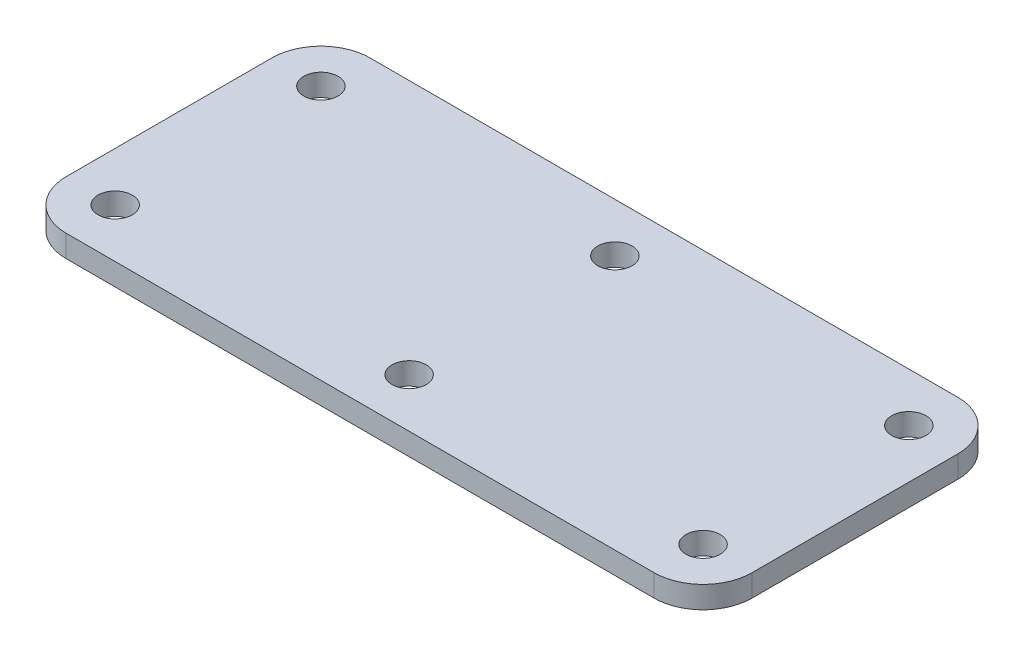
ISO-10303-21;
HEADER;
FILE_DESCRIPTION(('STEP AP214'),'2;1');
FILE_NAME('part.step','',(''),(''),'','','');
FILE_SCHEMA(('AUTOMOTIVE_DESIGN { 1 0 10303 214 1 1 1 1 }'));
ENDSEC;
DATA;
#1=APPLICATION_CONTEXT('core data for automotive mechanical design processes');
#2=APPLICATION_PROTOCOL_DEFINITION('international standard','automotive_design',2000,#1);
#3=PRODUCT_CONTEXT('',#1,'mechanical');
#4=PRODUCT('Part','Part','',(#3));
#5=PRODUCT_RELATED_PRODUCT_CATEGORY('part','',(#4));
#6=PRODUCT_DEFINITION_FORMATION('','',#4);
#7=PRODUCT_DEFINITION_CONTEXT('part definition',#1,'design');
#8=PRODUCT_DEFINITION('design','',#6,#7);
#9=PRODUCT_DEFINITION_SHAPE('','',#8);
#10=(LENGTH_UNIT() NAMED_UNIT(*) SI_UNIT(.MILLI.,.METRE.));
#11=(NAMED_UNIT(*) PLANE_ANGLE_UNIT() SI_UNIT($,.RADIAN.));
#12=(NAMED_UNIT(*) SI_UNIT($,.STERADIAN.) SOLID_ANGLE_UNIT());
#13=UNCERTAINTY_MEASURE_WITH_UNIT(LENGTH_MEASURE(1.E-05),#10,'distance_accuracy_value','');
#14=(GEOMETRIC_REPRESENTATION_CONTEXT(3) GLOBAL_UNCERTAINTY_ASSIGNED_CONTEXT((#13)) GLOBAL_UNIT_ASSIGNED_CONTEXT((#10,
#11,#12)) REPRESENTATION_CONTEXT('',''));
#15=CARTESIAN_POINT('',(0.,0.,0.));
#16=DIRECTION('',(0.,0.,1.));
#17=DIRECTION('',(1.,0.,0.));
#18=AXIS2_PLACEMENT_3D('',#15,#16,#17);
#19=CARTESIAN_POINT('',(-23.7329633323304,4.5,595.150162880876));
#20=DIRECTION('',(0.,1.,0.));
#21=DIRECTION('',(0.,0.,1.));
#22=AXIS2_PLACEMENT_3D('',#19,#20,#21);
#23=PLANE('',#22);
#24=CARTESIAN_POINT('',(96.2670366676696,4.5,595.150162880876));
#25=DIRECTION('',(0.,1.,0.));
#26=DIRECTION('',(0.,0.,1.));
#27=AXIS2_PLACEMENT_3D('',#24,#25,#26);
#28=CIRCLE('',#27,3.49999999999997);
#29=CARTESIAN_POINT('',(96.2670366676696,4.5,598.650162880876));
#30=VERTEX_POINT('',#29);
#31=EDGE_CURVE('E248',#30,#30,#28,.T.);
#32=ORIENTED_EDGE('',*,*,#31,.F.);
#33=EDGE_LOOP('',(#32));
#34=FACE_BOUND('',#33,.T.);
#35=CARTESIAN_POINT('',(-23.7329633323305,4.5,553.150162880876));
#36=DIRECTION('',(0.,1.,0.));
#37=DIRECTION('',(0.,0.,1.));
#38=AXIS2_PLACEMENT_3D('',#35,#36,#37);
#39=CIRCLE('',#38,3.49999999999996);
#40=CARTESIAN_POINT('',(-23.7329633323305,4.5,556.650162880876));
#41=VERTEX_POINT('',#40);
#42=EDGE_CURVE('E233',#41,#41,#39,.T.);
#43=ORIENTED_EDGE('',*,*,#42,.F.);
#44=EDGE_LOOP('',(#43));
#45=FACE_BOUND('',#44,.T.);
#46=CARTESIAN_POINT('',(36.2670366676696,4.5,553.150162880876));
#47=DIRECTION('',(0.,1.,0.));
#48=DIRECTION('',(0.,0.,1.));
#49=AXIS2_PLACEMENT_3D('',#46,#47,#48);
#50=CIRCLE('',#49,3.49999999999997);
#51=CARTESIAN_POINT('',(36.2670366676696,4.5,556.650162880876));
#52=VERTEX_POINT('',#51);
#53=EDGE_CURVE('E158',#52,#52,#50,.T.);
#54=ORIENTED_EDGE('',*,*,#53,.F.);
#55=EDGE_LOOP('',(#54));
#56=FACE_BOUND('',#55,.T.);
#57=CARTESIAN_POINT('',(-23.7329633323304,4.5,595.150162880876));
#58=DIRECTION('',(0.,1.,0.));
#59=DIRECTION('',(0.,0.,1.));
#60=AXIS2_PLACEMENT_3D('',#57,#58,#59);
#61=CIRCLE('',#60,10.);
#62=CARTESIAN_POINT('',(-33.7329633323304,4.5,595.150162880876));
#63=VERTEX_POINT('',#62);
#64=CARTESIAN_POINT('',(-23.7329633323304,4.5,605.150162880876));
#65=VERTEX_POINT('',#64);
#66=EDGE_CURVE('E176',#63,#65,#61,.T.);
#67=ORIENTED_EDGE('',*,*,#66,.T.);
#68=DIRECTION('',(1.,0.,0.));
#69=VECTOR('',#68,1.);
#70=CARTESIAN_POINT('',(-23.7329633323304,4.5,605.150162880876));
#71=LINE('',#70,#69);
#72=CARTESIAN_POINT('',(96.2670366676696,4.5,605.150162880876));
#73=VERTEX_POINT('',#72);
#74=EDGE_CURVE('E109',#65,#73,#71,.T.);
#75=ORIENTED_EDGE('',*,*,#74,.T.);
#76=CARTESIAN_POINT('',(96.2670366676696,4.5,595.150162880876));
#77=DIRECTION('',(0.,1.,0.));
#78=DIRECTION('',(0.,0.,1.));
#79=AXIS2_PLACEMENT_3D('',#76,#77,#78);
#80=CIRCLE('',#79,10.);
#81=CARTESIAN_POINT('',(106.26703666767,4.5,595.150162880876));
#82=VERTEX_POINT('',#81);
#83=EDGE_CURVE('E198',#73,#82,#80,.T.);
#84=ORIENTED_EDGE('',*,*,#83,.T.);
#85=DIRECTION('',(0.,0.,-1.));
#86=VECTOR('',#85,1.);
#87=CARTESIAN_POINT('',(106.26703666767,4.5,553.150162880876));
#88=LINE('',#87,#86);
#89=CARTESIAN_POINT('',(106.26703666767,4.5,553.150162880876));
#90=VERTEX_POINT('',#89);
#91=EDGE_CURVE('E212',#82,#90,#88,.T.);
#92=ORIENTED_EDGE('',*,*,#91,.T.);
#93=CARTESIAN_POINT('',(96.2670366676696,4.5,553.150162880876));
#94=DIRECTION('',(0.,1.,0.));
#95=DIRECTION('',(0.,0.,-1.));
#96=AXIS2_PLACEMENT_3D('',#93,#94,#95);
#97=CIRCLE('',#96,10.);
#98=CARTESIAN_POINT('',(96.2670366676696,4.5,543.150162880876));
#99=VERTEX_POINT('',#98);
#100=EDGE_CURVE('E132',#90,#99,#97,.T.);
#101=ORIENTED_EDGE('',*,*,#100,.T.);
#102=DIRECTION('',(-1.,0.,0.));
#103=VECTOR('',#102,1.);
#104=CARTESIAN_POINT('',(-23.7329633323304,4.5,543.150162880876));
#105=LINE('',#104,#103);
#106=CARTESIAN_POINT('',(-23.7329633323304,4.5,543.150162880876));
#107=VERTEX_POINT('',#106);
#108=EDGE_CURVE('E126',#99,#107,#105,.T.);
#109=ORIENTED_EDGE('',*,*,#108,.T.);
#110=CARTESIAN_POINT('',(-23.7329633323305,4.5,553.150162880876));
#111=DIRECTION('',(0.,1.,0.));
#112=DIRECTION('',(0.,0.,1.));
#113=AXIS2_PLACEMENT_3D('',#110,#111,#112);
#114=CIRCLE('',#113,10.);
#115=CARTESIAN_POINT('',(-33.7329633323305,4.5,553.150162880876));
#116=VERTEX_POINT('',#115);
#117=EDGE_CURVE('E130',#107,#116,#114,.T.);
#118=ORIENTED_EDGE('',*,*,#117,.T.);
#119=DIRECTION('',(0.,0.,1.));
#120=VECTOR('',#119,1.);
#121=CARTESIAN_POINT('',(-33.7329633323305,4.5,553.150162880876));
#122=LINE('',#121,#120);
#123=EDGE_CURVE('E59',#116,#63,#122,.T.);
#124=ORIENTED_EDGE('',*,*,#123,.T.);
#125=EDGE_LOOP('',(#67,#75,#84,#92,#101,#109,#118,#124));
#126=FACE_BOUND('',#125,.T.);
#127=CARTESIAN_POINT('',(96.2670366676695,4.5,553.150162880876));
#128=DIRECTION('',(0.,1.,0.));
#129=DIRECTION('',(0.,0.,1.));
#130=AXIS2_PLACEMENT_3D('',#127,#128,#129);
#131=CIRCLE('',#130,3.49999999999997);
#132=CARTESIAN_POINT('',(96.2670366676695,4.5,556.650162880876));
#133=VERTEX_POINT('',#132);
#134=EDGE_CURVE('E226',#133,#133,#131,.T.);
#135=ORIENTED_EDGE('',*,*,#134,.F.);
#136=EDGE_LOOP('',(#135));
#137=FACE_BOUND('',#136,.T.);
#138=CARTESIAN_POINT('',(36.2670366676696,4.5,595.150162880876));
#139=DIRECTION('',(0.,1.,0.));
#140=DIRECTION('',(0.,0.,1.));
#141=AXIS2_PLACEMENT_3D('',#138,#139,#140);
#142=CIRCLE('',#141,3.49999999999997);
#143=CARTESIAN_POINT('',(36.2670366676696,4.5,598.650162880876));
#144=VERTEX_POINT('',#143);
#145=EDGE_CURVE('E241',#144,#144,#142,.T.);
#146=ORIENTED_EDGE('',*,*,#145,.F.);
#147=EDGE_LOOP('',(#146));
#148=FACE_BOUND('',#147,.T.);
#149=CARTESIAN_POINT('',(-23.7329633323304,4.5,595.150162880876));
#150=DIRECTION('',(0.,1.,0.));
#151=DIRECTION('',(0.,0.,1.));
#152=AXIS2_PLACEMENT_3D('',#149,#150,#151);
#153=CIRCLE('',#152,3.49999999999996);
#154=CARTESIAN_POINT('',(-23.7329633323304,4.5,598.650162880876));
#155=VERTEX_POINT('',#154);
#156=EDGE_CURVE('E256',#155,#155,#153,.T.);
#157=ORIENTED_EDGE('',*,*,#156,.F.);
#158=EDGE_LOOP('',(#157));
#159=FACE_BOUND('',#158,.T.);
#160=ADVANCED_FACE('F38',(#34,#45,#56,#126,#137,#148,#159),#23,.T.);
#161=CARTESIAN_POINT('',(-23.7329633323304,0.,595.150162880876));
#162=DIRECTION('',(0.,1.,0.));
#163=DIRECTION('',(0.,0.,1.));
#164=AXIS2_PLACEMENT_3D('',#161,#162,#163);
#165=PLANE('',#164);
#166=CARTESIAN_POINT('',(-23.7329633323304,0.,595.150162880876));
#167=DIRECTION('',(0.,1.,0.));
#168=DIRECTION('',(0.,0.,1.));
#169=AXIS2_PLACEMENT_3D('',#166,#167,#168);
#170=CIRCLE('',#169,10.);
#171=CARTESIAN_POINT('',(-33.7329633323304,0.,595.150162880876));
#172=VERTEX_POINT('',#171);
#173=CARTESIAN_POINT('',(-23.7329633323304,0.,605.150162880876));
#174=VERTEX_POINT('',#173);
#175=EDGE_CURVE('E153',#172,#174,#170,.T.);
#176=ORIENTED_EDGE('',*,*,#175,.F.);
#177=DIRECTION('',(0.,0.,1.));
#178=VECTOR('',#177,1.);
#179=CARTESIAN_POINT('',(-33.7329633323305,0.,553.150162880876));
#180=LINE('',#179,#178);
#181=CARTESIAN_POINT('',(-33.7329633323305,0.,553.150162880876));
#182=VERTEX_POINT('',#181);
#183=EDGE_CURVE('E100',#182,#172,#180,.T.);
#184=ORIENTED_EDGE('',*,*,#183,.F.);
#185=CARTESIAN_POINT('',(-23.7329633323305,0.,553.150162880876));
#186=DIRECTION('',(0.,1.,0.));
#187=DIRECTION('',(0.,0.,1.));
#188=AXIS2_PLACEMENT_3D('',#185,#186,#187);
#189=CIRCLE('',#188,10.);
#190=CARTESIAN_POINT('',(-23.7329633323304,0.,543.150162880876));
#191=VERTEX_POINT('',#190);
#192=EDGE_CURVE('E94',#191,#182,#189,.T.);
#193=ORIENTED_EDGE('',*,*,#192,.F.);
#194=DIRECTION('',(-1.,0.,0.));
#195=VECTOR('',#194,1.);
#196=CARTESIAN_POINT('',(-23.7329633323304,0.,543.150162880876));
#197=LINE('',#196,#195);
#198=CARTESIAN_POINT('',(96.2670366676696,0.,543.150162880876));
#199=VERTEX_POINT('',#198);
#200=EDGE_CURVE('E141',#199,#191,#197,.T.);
#201=ORIENTED_EDGE('',*,*,#200,.F.);
#202=CARTESIAN_POINT('',(96.2670366676696,0.,553.150162880876));
#203=DIRECTION('',(0.,1.,0.));
#204=DIRECTION('',(0.,0.,-1.));
#205=AXIS2_PLACEMENT_3D('',#202,#203,#204);
#206=CIRCLE('',#205,10.);
#207=CARTESIAN_POINT('',(106.26703666767,0.,553.150162880876));
#208=VERTEX_POINT('',#207);
#209=EDGE_CURVE('E167',#208,#199,#206,.T.);
#210=ORIENTED_EDGE('',*,*,#209,.F.);
#211=DIRECTION('',(0.,0.,-1.));
#212=VECTOR('',#211,1.);
#213=CARTESIAN_POINT('',(106.26703666767,0.,553.150162880876));
#214=LINE('',#213,#212);
#215=CARTESIAN_POINT('',(106.26703666767,0.,595.150162880876));
#216=VERTEX_POINT('',#215);
#217=EDGE_CURVE('E164',#216,#208,#214,.T.);
#218=ORIENTED_EDGE('',*,*,#217,.F.);
#219=CARTESIAN_POINT('',(96.2670366676696,0.,595.150162880876));
#220=DIRECTION('',(0.,1.,0.));
#221=DIRECTION('',(0.,0.,1.));
#222=AXIS2_PLACEMENT_3D('',#219,#220,#221);
#223=CIRCLE('',#222,10.);
#224=CARTESIAN_POINT('',(96.2670366676696,0.,605.150162880876));
#225=VERTEX_POINT('',#224);
#226=EDGE_CURVE('E161',#225,#216,#223,.T.);
#227=ORIENTED_EDGE('',*,*,#226,.F.);
#228=DIRECTION('',(1.,0.,0.));
#229=VECTOR('',#228,1.);
#230=CARTESIAN_POINT('',(-23.7329633323304,0.,605.150162880876));
#231=LINE('',#230,#229);
#232=EDGE_CURVE('E157',#174,#225,#231,.T.);
#233=ORIENTED_EDGE('',*,*,#232,.F.);
#234=EDGE_LOOP('',(#176,#184,#193,#201,#210,#218,#227,#233));
#235=FACE_BOUND('',#234,.T.);
#236=CARTESIAN_POINT('',(36.2670366676696,0.,553.150162880876));
#237=DIRECTION('',(0.,1.,0.));
#238=DIRECTION('',(0.,0.,1.));
#239=AXIS2_PLACEMENT_3D('',#236,#237,#238);
#240=CIRCLE('',#239,3.49999999999997);
#241=CARTESIAN_POINT('',(36.2670366676696,0.,556.650162880876));
#242=VERTEX_POINT('',#241);
#243=EDGE_CURVE('E222',#242,#242,#240,.T.);
#244=ORIENTED_EDGE('',*,*,#243,.T.);
#245=EDGE_LOOP('',(#244));
#246=FACE_BOUND('',#245,.T.);
#247=CARTESIAN_POINT('',(96.2670366676695,0.,553.150162880876));
#248=DIRECTION('',(0.,1.,0.));
#249=DIRECTION('',(0.,0.,1.));
#250=AXIS2_PLACEMENT_3D('',#247,#248,#249);
#251=CIRCLE('',#250,3.49999999999997);
#252=CARTESIAN_POINT('',(96.2670366676695,0.,556.650162880876));
#253=VERTEX_POINT('',#252);
#254=EDGE_CURVE('E230',#253,#253,#251,.T.);
#255=ORIENTED_EDGE('',*,*,#254,.T.);
#256=EDGE_LOOP('',(#255));
#257=FACE_BOUND('',#256,.T.);
#258=CARTESIAN_POINT('',(-23.7329633323305,0.,553.150162880876));
#259=DIRECTION('',(0.,1.,0.));
#260=DIRECTION('',(0.,0.,1.));
#261=AXIS2_PLACEMENT_3D('',#258,#259,#260);
#262=CIRCLE('',#261,3.49999999999996);
#263=CARTESIAN_POINT('',(-23.7329633323305,0.,556.650162880876));
#264=VERTEX_POINT('',#263);
#265=EDGE_CURVE('E237',#264,#264,#262,.T.);
#266=ORIENTED_EDGE('',*,*,#265,.T.);
#267=EDGE_LOOP('',(#266));
#268=FACE_BOUND('',#267,.T.);
#269=CARTESIAN_POINT('',(36.2670366676696,0.,595.150162880876));
#270=DIRECTION('',(0.,1.,0.));
#271=DIRECTION('',(0.,0.,1.));
#272=AXIS2_PLACEMENT_3D('',#269,#270,#271);
#273=CIRCLE('',#272,3.49999999999997);
#274=CARTESIAN_POINT('',(36.2670366676696,0.,598.650162880876));
#275=VERTEX_POINT('',#274);
#276=EDGE_CURVE('E244',#275,#275,#273,.T.);
#277=ORIENTED_EDGE('',*,*,#276,.T.);
#278=EDGE_LOOP('',(#277));
#279=FACE_BOUND('',#278,.T.);
#280=CARTESIAN_POINT('',(96.2670366676696,0.,595.150162880876));
#281=DIRECTION('',(0.,1.,0.));
#282=DIRECTION('',(0.,0.,1.));
#283=AXIS2_PLACEMENT_3D('',#280,#281,#282);
#284=CIRCLE('',#283,3.49999999999997);
#285=CARTESIAN_POINT('',(96.2670366676696,0.,598.650162880876));
#286=VERTEX_POINT('',#285);
#287=EDGE_CURVE('E252',#286,#286,#284,.T.);
#288=ORIENTED_EDGE('',*,*,#287,.T.);
#289=EDGE_LOOP('',(#288));
#290=FACE_BOUND('',#289,.T.);
#291=CARTESIAN_POINT('',(-23.7329633323304,0.,595.150162880876));
#292=DIRECTION('',(0.,1.,0.));
#293=DIRECTION('',(0.,0.,1.));
#294=AXIS2_PLACEMENT_3D('',#291,#292,#293);
#295=CIRCLE('',#294,3.49999999999996);
#296=CARTESIAN_POINT('',(-23.7329633323304,0.,598.650162880876));
#297=VERTEX_POINT('',#296);
#298=EDGE_CURVE('E260',#297,#297,#295,.T.);
#299=ORIENTED_EDGE('',*,*,#298,.T.);
#300=EDGE_LOOP('',(#299));
#301=FACE_BOUND('',#300,.T.);
#302=ADVANCED_FACE('F202',(#235,#246,#257,#268,#279,#290,#301),#165,.F.);
#303=CARTESIAN_POINT('',(-23.7329633323304,4.5,595.150162880876));
#304=DIRECTION('',(0.,-1.,0.));
#305=DIRECTION('',(0.,0.,-1.));
#306=AXIS2_PLACEMENT_3D('',#303,#304,#305);
#307=CYLINDRICAL_SURFACE('',#306,10.);
#308=ORIENTED_EDGE('',*,*,#175,.T.);
#309=DIRECTION('',(0.,-1.,0.));
#310=VECTOR('',#309,1.);
#311=CARTESIAN_POINT('',(-23.7329633323304,4.5,605.150162880876));
#312=LINE('',#311,#310);
#313=EDGE_CURVE('E11',#65,#174,#312,.T.);
#314=ORIENTED_EDGE('',*,*,#313,.F.);
#315=ORIENTED_EDGE('',*,*,#66,.F.);
#316=DIRECTION('',(0.,-1.,0.));
#317=VECTOR('',#316,1.);
#318=CARTESIAN_POINT('',(-33.7329633323304,4.5,595.150162880876));
#319=LINE('',#318,#317);
#320=EDGE_CURVE('E149',#63,#172,#319,.T.);
#321=ORIENTED_EDGE('',*,*,#320,.T.);
#322=EDGE_LOOP('',(#308,#314,#315,#321));
#323=FACE_BOUND('',#322,.T.);
#324=ADVANCED_FACE('F40',(#323),#307,.T.);
#325=CARTESIAN_POINT('',(-23.7329633323304,4.5,605.150162880876));
#326=DIRECTION('',(0.,0.,-1.));
#327=DIRECTION('',(-1.,0.,0.));
#328=AXIS2_PLACEMENT_3D('',#325,#326,#327);
#329=PLANE('',#328);
#330=ORIENTED_EDGE('',*,*,#232,.T.);
#331=DIRECTION('',(0.,-1.,0.));
#332=VECTOR('',#331,1.);
#333=CARTESIAN_POINT('',(96.2670366676696,4.5,605.150162880876));
#334=LINE('',#333,#332);
#335=EDGE_CURVE('E48',#73,#225,#334,.T.);
#336=ORIENTED_EDGE('',*,*,#335,.F.);
#337=ORIENTED_EDGE('',*,*,#74,.F.);
#338=ORIENTED_EDGE('',*,*,#313,.T.);
#339=EDGE_LOOP('',(#330,#336,#337,#338));
#340=FACE_BOUND('',#339,.T.);
#341=ADVANCED_FACE('F296',(#340),#329,.F.);
#342=CARTESIAN_POINT('',(96.2670366676696,4.5,595.150162880876));
#343=DIRECTION('',(0.,-1.,0.));
#344=DIRECTION('',(0.,0.,-1.));
#345=AXIS2_PLACEMENT_3D('',#342,#343,#344);
#346=CYLINDRICAL_SURFACE('',#345,10.);
#347=ORIENTED_EDGE('',*,*,#226,.T.);
#348=DIRECTION('',(0.,-1.,0.));
#349=VECTOR('',#348,1.);
#350=CARTESIAN_POINT('',(106.26703666767,4.5,595.150162880876));
#351=LINE('',#350,#349);
#352=EDGE_CURVE('E187',#82,#216,#351,.T.);
#353=ORIENTED_EDGE('',*,*,#352,.F.);
#354=ORIENTED_EDGE('',*,*,#83,.F.);
#355=ORIENTED_EDGE('',*,*,#335,.T.);
#356=EDGE_LOOP('',(#347,#353,#354,#355));
#357=FACE_BOUND('',#356,.T.);
#358=ADVANCED_FACE('F196',(#357),#346,.T.);
#359=CARTESIAN_POINT('',(106.26703666767,4.5,553.150162880876));
#360=DIRECTION('',(-1.,0.,0.));
#361=DIRECTION('',(0.,0.,1.));
#362=AXIS2_PLACEMENT_3D('',#359,#360,#361);
#363=PLANE('',#362);
#364=ORIENTED_EDGE('',*,*,#217,.T.);
#365=DIRECTION('',(0.,-1.,0.));
#366=VECTOR('',#365,1.);
#367=CARTESIAN_POINT('',(106.26703666767,4.5,553.150162880876));
#368=LINE('',#367,#366);
#369=EDGE_CURVE('E183',#90,#208,#368,.T.);
#370=ORIENTED_EDGE('',*,*,#369,.F.);
#371=ORIENTED_EDGE('',*,*,#91,.F.);
#372=ORIENTED_EDGE('',*,*,#352,.T.);
#373=EDGE_LOOP('',(#364,#370,#371,#372));
#374=FACE_BOUND('',#373,.T.);
#375=ADVANCED_FACE('F207',(#374),#363,.F.);
#376=CARTESIAN_POINT('',(96.2670366676696,4.5,553.150162880876));
#377=DIRECTION('',(0.,-1.,0.));
#378=DIRECTION('',(0.,0.,-1.));
#379=AXIS2_PLACEMENT_3D('',#376,#377,#378);
#380=CYLINDRICAL_SURFACE('',#379,10.);
#381=ORIENTED_EDGE('',*,*,#209,.T.);
#382=DIRECTION('',(0.,-1.,0.));
#383=VECTOR('',#382,1.);
#384=CARTESIAN_POINT('',(96.2670366676696,4.5,543.150162880876));
#385=LINE('',#384,#383);
#386=EDGE_CURVE('E143',#99,#199,#385,.T.);
#387=ORIENTED_EDGE('',*,*,#386,.F.);
#388=ORIENTED_EDGE('',*,*,#100,.F.);
#389=ORIENTED_EDGE('',*,*,#369,.T.);
#390=EDGE_LOOP('',(#381,#387,#388,#389));
#391=FACE_BOUND('',#390,.T.);
#392=ADVANCED_FACE('F210',(#391),#380,.T.);
#393=CARTESIAN_POINT('',(-23.7329633323304,4.5,543.150162880876));
#394=DIRECTION('',(0.,0.,1.));
#395=DIRECTION('',(1.,0.,0.));
#396=AXIS2_PLACEMENT_3D('',#393,#394,#395);
#397=PLANE('',#396);
#398=ORIENTED_EDGE('',*,*,#200,.T.);
#399=DIRECTION('',(0.,-1.,0.));
#400=VECTOR('',#399,1.);
#401=CARTESIAN_POINT('',(-23.7329633323304,4.5,543.150162880876));
#402=LINE('',#401,#400);
#403=EDGE_CURVE('E138',#107,#191,#402,.T.);
#404=ORIENTED_EDGE('',*,*,#403,.F.);
#405=ORIENTED_EDGE('',*,*,#108,.F.);
#406=ORIENTED_EDGE('',*,*,#386,.T.);
#407=EDGE_LOOP('',(#398,#404,#405,#406));
#408=FACE_BOUND('',#407,.T.);
#409=ADVANCED_FACE('F139',(#408),#397,.F.);
#410=CARTESIAN_POINT('',(-23.7329633323305,4.5,553.150162880876));
#411=DIRECTION('',(0.,-1.,0.));
#412=DIRECTION('',(0.,0.,-1.));
#413=AXIS2_PLACEMENT_3D('',#410,#411,#412);
#414=CYLINDRICAL_SURFACE('',#413,10.);
#415=ORIENTED_EDGE('',*,*,#192,.T.);
#416=DIRECTION('',(0.,-1.,0.));
#417=VECTOR('',#416,1.);
#418=CARTESIAN_POINT('',(-33.7329633323305,4.5,553.150162880876));
#419=LINE('',#418,#417);
#420=EDGE_CURVE('E144',#116,#182,#419,.T.);
#421=ORIENTED_EDGE('',*,*,#420,.F.);
#422=ORIENTED_EDGE('',*,*,#117,.F.);
#423=ORIENTED_EDGE('',*,*,#403,.T.);
#424=EDGE_LOOP('',(#415,#421,#422,#423));
#425=FACE_BOUND('',#424,.T.);
#426=ADVANCED_FACE('F146',(#425),#414,.T.);
#427=CARTESIAN_POINT('',(-33.7329633323305,4.5,553.150162880876));
#428=DIRECTION('',(1.,0.,0.));
#429=DIRECTION('',(0.,0.,-1.));
#430=AXIS2_PLACEMENT_3D('',#427,#428,#429);
#431=PLANE('',#430);
#432=ORIENTED_EDGE('',*,*,#183,.T.);
#433=ORIENTED_EDGE('',*,*,#320,.F.);
#434=ORIENTED_EDGE('',*,*,#123,.F.);
#435=ORIENTED_EDGE('',*,*,#420,.T.);
#436=EDGE_LOOP('',(#432,#433,#434,#435));
#437=FACE_BOUND('',#436,.T.);
#438=ADVANCED_FACE('F284',(#437),#431,.F.);
#439=CARTESIAN_POINT('',(36.2670366676696,4.5,553.150162880876));
#440=DIRECTION('',(0.,-1.,0.));
#441=DIRECTION('',(0.,0.,-1.));
#442=AXIS2_PLACEMENT_3D('',#439,#440,#441);
#443=CYLINDRICAL_SURFACE('',#442,3.49999999999997);
#444=ORIENTED_EDGE('',*,*,#53,.T.);
#445=EDGE_LOOP('',(#444));
#446=FACE_BOUND('',#445,.T.);
#447=ORIENTED_EDGE('',*,*,#243,.F.);
#448=EDGE_LOOP('',(#447));
#449=FACE_BOUND('',#448,.T.);
#450=ADVANCED_FACE('F281',(#446,#449),#443,.F.);
#451=CARTESIAN_POINT('',(96.2670366676695,4.5,553.150162880876));
#452=DIRECTION('',(0.,-1.,0.));
#453=DIRECTION('',(0.,0.,-1.));
#454=AXIS2_PLACEMENT_3D('',#451,#452,#453);
#455=CYLINDRICAL_SURFACE('',#454,3.49999999999997);
#456=ORIENTED_EDGE('',*,*,#134,.T.);
#457=EDGE_LOOP('',(#456));
#458=FACE_BOUND('',#457,.T.);
#459=ORIENTED_EDGE('',*,*,#254,.F.);
#460=EDGE_LOOP('',(#459));
#461=FACE_BOUND('',#460,.T.);
#462=ADVANCED_FACE('F363',(#458,#461),#455,.F.);
#463=CARTESIAN_POINT('',(-23.7329633323305,4.5,553.150162880876));
#464=DIRECTION('',(0.,-1.,0.));
#465=DIRECTION('',(0.,0.,-1.));
#466=AXIS2_PLACEMENT_3D('',#463,#464,#465);
#467=CYLINDRICAL_SURFACE('',#466,3.49999999999996);
#468=ORIENTED_EDGE('',*,*,#42,.T.);
#469=EDGE_LOOP('',(#468));
#470=FACE_BOUND('',#469,.T.);
#471=ORIENTED_EDGE('',*,*,#265,.F.);
#472=EDGE_LOOP('',(#471));
#473=FACE_BOUND('',#472,.T.);
#474=ADVANCED_FACE('F371',(#470,#473),#467,.F.);
#475=CARTESIAN_POINT('',(36.2670366676696,4.5,595.150162880876));
#476=DIRECTION('',(0.,-1.,0.));
#477=DIRECTION('',(0.,0.,-1.));
#478=AXIS2_PLACEMENT_3D('',#475,#476,#477);
#479=CYLINDRICAL_SURFACE('',#478,3.49999999999997);
#480=ORIENTED_EDGE('',*,*,#145,.T.);
#481=EDGE_LOOP('',(#480));
#482=FACE_BOUND('',#481,.T.);
#483=ORIENTED_EDGE('',*,*,#276,.F.);
#484=EDGE_LOOP('',(#483));
#485=FACE_BOUND('',#484,.T.);
#486=ADVANCED_FACE('F379',(#482,#485),#479,.F.);
#487=CARTESIAN_POINT('',(96.2670366676696,4.5,595.150162880876));
#488=DIRECTION('',(0.,-1.,0.));
#489=DIRECTION('',(0.,0.,-1.));
#490=AXIS2_PLACEMENT_3D('',#487,#488,#489);
#491=CYLINDRICAL_SURFACE('',#490,3.49999999999997);
#492=ORIENTED_EDGE('',*,*,#31,.T.);
#493=EDGE_LOOP('',(#492));
#494=FACE_BOUND('',#493,.T.);
#495=ORIENTED_EDGE('',*,*,#287,.F.);
#496=EDGE_LOOP('',(#495));
#497=FACE_BOUND('',#496,.T.);
#498=ADVANCED_FACE('F388',(#494,#497),#491,.F.);
#499=CARTESIAN_POINT('',(-23.7329633323304,4.5,595.150162880876));
#500=DIRECTION('',(0.,-1.,0.));
#501=DIRECTION('',(0.,0.,-1.));
#502=AXIS2_PLACEMENT_3D('',#499,#500,#501);
#503=CYLINDRICAL_SURFACE('',#502,3.49999999999996);
#504=ORIENTED_EDGE('',*,*,#156,.T.);
#505=EDGE_LOOP('',(#504));
#506=FACE_BOUND('',#505,.T.);
#507=ORIENTED_EDGE('',*,*,#298,.F.);
#508=EDGE_LOOP('',(#507));
#509=FACE_BOUND('',#508,.T.);
#510=ADVANCED_FACE('F268',(#506,#509),#503,.F.);
#511=CLOSED_SHELL('',(#160,#302,#324,#341,#358,#375,#392,#409,#426,#438,#450,#462,#474,#486,
#498,#510));
#512=MANIFOLD_SOLID_BREP('B2',#511);
#513=ADVANCED_BREP_SHAPE_REPRESENTATION('',(#18,#512),#14);
#514=SHAPE_DEFINITION_REPRESENTATION(#9,#513);
ENDSEC;
END-ISO-10303-21;
